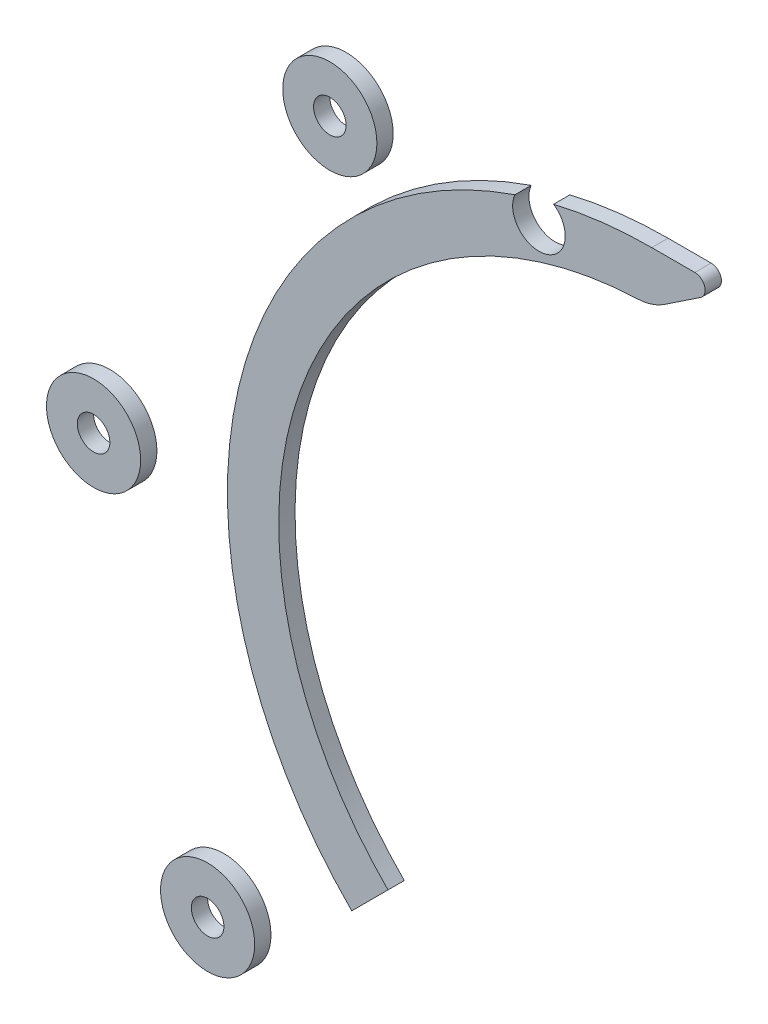
ISO-10303-21;
HEADER;
FILE_DESCRIPTION(('STEP AP214'),'2;1');
FILE_NAME('part.step','',(''),(''),'','','');
FILE_SCHEMA(('AUTOMOTIVE_DESIGN { 1 0 10303 214 1 1 1 1 }'));
ENDSEC;
DATA;
#1=APPLICATION_CONTEXT('core data for automotive mechanical design processes');
#2=APPLICATION_PROTOCOL_DEFINITION('international standard','automotive_design',2000,#1);
#3=PRODUCT_CONTEXT('',#1,'mechanical');
#4=PRODUCT('Part','Part','',(#3));
#5=PRODUCT_RELATED_PRODUCT_CATEGORY('part','',(#4));
#6=PRODUCT_DEFINITION_FORMATION('','',#4);
#7=PRODUCT_DEFINITION_CONTEXT('part definition',#1,'design');
#8=PRODUCT_DEFINITION('design','',#6,#7);
#9=PRODUCT_DEFINITION_SHAPE('','',#8);
#10=(LENGTH_UNIT() NAMED_UNIT(*) SI_UNIT(.MILLI.,.METRE.));
#11=(NAMED_UNIT(*) PLANE_ANGLE_UNIT() SI_UNIT($,.RADIAN.));
#12=(NAMED_UNIT(*) SI_UNIT($,.STERADIAN.) SOLID_ANGLE_UNIT());
#13=UNCERTAINTY_MEASURE_WITH_UNIT(LENGTH_MEASURE(1.E-05),#10,'distance_accuracy_value','');
#14=(GEOMETRIC_REPRESENTATION_CONTEXT(3) GLOBAL_UNCERTAINTY_ASSIGNED_CONTEXT((#13)) GLOBAL_UNIT_ASSIGNED_CONTEXT((#10,
#11,#12)) REPRESENTATION_CONTEXT('',''));
#15=CARTESIAN_POINT('',(0.,0.,0.));
#16=DIRECTION('',(0.,0.,1.));
#17=DIRECTION('',(1.,0.,0.));
#18=AXIS2_PLACEMENT_3D('',#15,#16,#17);
#19=CARTESIAN_POINT('',(-86.5859641184804,-73.6105546837081,-3.175));
#20=DIRECTION('',(0.,0.,1.));
#21=DIRECTION('',(1.,0.,0.));
#22=AXIS2_PLACEMENT_3D('',#19,#20,#21);
#23=CYLINDRICAL_SURFACE('',#22,3.175);
#24=CARTESIAN_POINT('',(-86.5859641184804,-73.6105546837081,-3.175));
#25=DIRECTION('',(0.,0.,1.));
#26=DIRECTION('',(1.,0.,0.));
#27=AXIS2_PLACEMENT_3D('',#24,#25,#26);
#28=CIRCLE('',#27,3.175);
#29=CARTESIAN_POINT('',(-83.4109641184804,-73.6105546837081,-3.175));
#30=VERTEX_POINT('',#29);
#31=EDGE_CURVE('E65',#30,#30,#28,.T.);
#32=ORIENTED_EDGE('',*,*,#31,.F.);
#33=EDGE_LOOP('',(#32));
#34=FACE_BOUND('',#33,.T.);
#35=CARTESIAN_POINT('',(-86.5859641184804,-73.6105546837081,0.));
#36=DIRECTION('',(0.,0.,1.));
#37=DIRECTION('',(1.,0.,0.));
#38=AXIS2_PLACEMENT_3D('',#35,#36,#37);
#39=CIRCLE('',#38,3.175);
#40=CARTESIAN_POINT('',(-83.4109641184804,-73.6105546837081,0.));
#41=VERTEX_POINT('',#40);
#42=EDGE_CURVE('E71',#41,#41,#39,.T.);
#43=ORIENTED_EDGE('',*,*,#42,.T.);
#44=EDGE_LOOP('',(#43));
#45=FACE_BOUND('',#44,.T.);
#46=ADVANCED_FACE('F58',(#34,#45),#23,.F.);
#47=CARTESIAN_POINT('',(-86.5859641184804,-73.6105546837081,-3.175));
#48=DIRECTION('',(0.,0.,1.));
#49=DIRECTION('',(1.,0.,0.));
#50=AXIS2_PLACEMENT_3D('',#47,#48,#49);
#51=CYLINDRICAL_SURFACE('',#50,9.175);
#52=CARTESIAN_POINT('',(-86.5859641184804,-73.6105546837081,-3.175));
#53=DIRECTION('',(0.,0.,1.));
#54=DIRECTION('',(1.,0.,0.));
#55=AXIS2_PLACEMENT_3D('',#52,#53,#54);
#56=CIRCLE('',#55,9.175);
#57=CARTESIAN_POINT('',(-77.4109641184804,-73.6105546837081,-3.175));
#58=VERTEX_POINT('',#57);
#59=EDGE_CURVE('E12',#58,#58,#56,.T.);
#60=ORIENTED_EDGE('',*,*,#59,.T.);
#61=EDGE_LOOP('',(#60));
#62=FACE_BOUND('',#61,.T.);
#63=CARTESIAN_POINT('',(-86.5859641184804,-73.6105546837081,0.));
#64=DIRECTION('',(0.,0.,1.));
#65=DIRECTION('',(1.,0.,0.));
#66=AXIS2_PLACEMENT_3D('',#63,#64,#65);
#67=CIRCLE('',#66,9.175);
#68=CARTESIAN_POINT('',(-77.4109641184804,-73.6105546837081,0.));
#69=VERTEX_POINT('',#68);
#70=EDGE_CURVE('E61',#69,#69,#67,.T.);
#71=ORIENTED_EDGE('',*,*,#70,.F.);
#72=EDGE_LOOP('',(#71));
#73=FACE_BOUND('',#72,.T.);
#74=ADVANCED_FACE('F80',(#62,#73),#51,.T.);
#75=CARTESIAN_POINT('',(0.,0.,-3.175));
#76=DIRECTION('',(0.,0.,1.));
#77=DIRECTION('',(1.,0.,0.));
#78=AXIS2_PLACEMENT_3D('',#75,#76,#77);
#79=PLANE('',#78);
#80=ORIENTED_EDGE('',*,*,#31,.T.);
#81=EDGE_LOOP('',(#80));
#82=FACE_BOUND('',#81,.T.);
#83=ORIENTED_EDGE('',*,*,#59,.F.);
#84=EDGE_LOOP('',(#83));
#85=FACE_BOUND('',#84,.T.);
#86=ADVANCED_FACE('F82',(#82,#85),#79,.F.);
#87=CARTESIAN_POINT('',(0.,0.,0.));
#88=DIRECTION('',(0.,0.,1.));
#89=DIRECTION('',(1.,0.,0.));
#90=AXIS2_PLACEMENT_3D('',#87,#88,#89);
#91=PLANE('',#90);
#92=ORIENTED_EDGE('',*,*,#42,.F.);
#93=EDGE_LOOP('',(#92));
#94=FACE_BOUND('',#93,.T.);
#95=ORIENTED_EDGE('',*,*,#70,.T.);
#96=EDGE_LOOP('',(#95));
#97=FACE_BOUND('',#96,.T.);
#98=ADVANCED_FACE('F78',(#94,#97),#91,.T.);
#99=CLOSED_SHELL('',(#46,#74,#86,#98));
#100=MANIFOLD_SOLID_BREP('B2',#99);
#101=CARTESIAN_POINT('',(-108.81658982148,-3.00343431559438,-3.175));
#102=DIRECTION('',(0.,0.,1.));
#103=DIRECTION('',(1.,0.,0.));
#104=AXIS2_PLACEMENT_3D('',#101,#102,#103);
#105=CYLINDRICAL_SURFACE('',#104,3.175);
#106=CARTESIAN_POINT('',(-108.81658982148,-3.00343431559438,-3.175));
#107=DIRECTION('',(0.,0.,1.));
#108=DIRECTION('',(1.,0.,0.));
#109=AXIS2_PLACEMENT_3D('',#106,#107,#108);
#110=CIRCLE('',#109,3.175);
#111=CARTESIAN_POINT('',(-105.64158982148,-3.00343431559438,-3.175));
#112=VERTEX_POINT('',#111);
#113=EDGE_CURVE('E134',#112,#112,#110,.T.);
#114=ORIENTED_EDGE('',*,*,#113,.F.);
#115=EDGE_LOOP('',(#114));
#116=FACE_BOUND('',#115,.T.);
#117=CARTESIAN_POINT('',(-108.81658982148,-3.00343431559438,0.));
#118=DIRECTION('',(0.,0.,1.));
#119=DIRECTION('',(1.,0.,0.));
#120=AXIS2_PLACEMENT_3D('',#117,#118,#119);
#121=CIRCLE('',#120,3.175);
#122=CARTESIAN_POINT('',(-105.64158982148,-3.00343431559438,0.));
#123=VERTEX_POINT('',#122);
#124=EDGE_CURVE('E140',#123,#123,#121,.T.);
#125=ORIENTED_EDGE('',*,*,#124,.T.);
#126=EDGE_LOOP('',(#125));
#127=FACE_BOUND('',#126,.T.);
#128=ADVANCED_FACE('F127',(#116,#127),#105,.F.);
#129=CARTESIAN_POINT('',(-108.81658982148,-3.00343431559438,-3.175));
#130=DIRECTION('',(0.,0.,1.));
#131=DIRECTION('',(1.,0.,0.));
#132=AXIS2_PLACEMENT_3D('',#129,#130,#131);
#133=CYLINDRICAL_SURFACE('',#132,9.17499999999998);
#134=CARTESIAN_POINT('',(-108.81658982148,-3.00343431559438,-3.175));
#135=DIRECTION('',(0.,0.,1.));
#136=DIRECTION('',(1.,0.,0.));
#137=AXIS2_PLACEMENT_3D('',#134,#135,#136);
#138=CIRCLE('',#137,9.17499999999998);
#139=CARTESIAN_POINT('',(-99.6415898214804,-3.00343431559438,-3.175));
#140=VERTEX_POINT('',#139);
#141=EDGE_CURVE('E57',#140,#140,#138,.T.);
#142=ORIENTED_EDGE('',*,*,#141,.T.);
#143=EDGE_LOOP('',(#142));
#144=FACE_BOUND('',#143,.T.);
#145=CARTESIAN_POINT('',(-108.81658982148,-3.00343431559438,0.));
#146=DIRECTION('',(0.,0.,1.));
#147=DIRECTION('',(1.,0.,0.));
#148=AXIS2_PLACEMENT_3D('',#145,#146,#147);
#149=CIRCLE('',#148,9.17499999999998);
#150=CARTESIAN_POINT('',(-99.6415898214804,-3.00343431559438,0.));
#151=VERTEX_POINT('',#150);
#152=EDGE_CURVE('E130',#151,#151,#149,.T.);
#153=ORIENTED_EDGE('',*,*,#152,.F.);
#154=EDGE_LOOP('',(#153));
#155=FACE_BOUND('',#154,.T.);
#156=ADVANCED_FACE('F149',(#144,#155),#133,.T.);
#157=CARTESIAN_POINT('',(0.,0.,-3.175));
#158=DIRECTION('',(0.,0.,1.));
#159=DIRECTION('',(1.,0.,0.));
#160=AXIS2_PLACEMENT_3D('',#157,#158,#159);
#161=PLANE('',#160);
#162=ORIENTED_EDGE('',*,*,#113,.T.);
#163=EDGE_LOOP('',(#162));
#164=FACE_BOUND('',#163,.T.);
#165=ORIENTED_EDGE('',*,*,#141,.F.);
#166=EDGE_LOOP('',(#165));
#167=FACE_BOUND('',#166,.T.);
#168=ADVANCED_FACE('F151',(#164,#167),#161,.F.);
#169=CARTESIAN_POINT('',(0.,0.,0.));
#170=DIRECTION('',(0.,0.,1.));
#171=DIRECTION('',(1.,0.,0.));
#172=AXIS2_PLACEMENT_3D('',#169,#170,#171);
#173=PLANE('',#172);
#174=ORIENTED_EDGE('',*,*,#124,.F.);
#175=EDGE_LOOP('',(#174));
#176=FACE_BOUND('',#175,.T.);
#177=ORIENTED_EDGE('',*,*,#152,.T.);
#178=EDGE_LOOP('',(#177));
#179=FACE_BOUND('',#178,.T.);
#180=ADVANCED_FACE('F147',(#176,#179),#173,.T.);
#181=CLOSED_SHELL('',(#128,#156,#168,#180));
#182=MANIFOLD_SOLID_BREP('B7',#181);
#183=CARTESIAN_POINT('',(-62.7632545375718,73.5491765689237,-3.175));
#184=DIRECTION('',(0.,0.,1.));
#185=DIRECTION('',(1.,0.,0.));
#186=AXIS2_PLACEMENT_3D('',#183,#184,#185);
#187=CYLINDRICAL_SURFACE('',#186,3.175);
#188=CARTESIAN_POINT('',(-62.7632545375718,73.5491765689237,-3.175));
#189=DIRECTION('',(0.,0.,1.));
#190=DIRECTION('',(1.,0.,0.));
#191=AXIS2_PLACEMENT_3D('',#188,#189,#190);
#192=CIRCLE('',#191,3.175);
#193=CARTESIAN_POINT('',(-59.5882545375718,73.5491765689237,-3.175));
#194=VERTEX_POINT('',#193);
#195=EDGE_CURVE('E204',#194,#194,#192,.T.);
#196=ORIENTED_EDGE('',*,*,#195,.F.);
#197=EDGE_LOOP('',(#196));
#198=FACE_BOUND('',#197,.T.);
#199=CARTESIAN_POINT('',(-62.7632545375718,73.5491765689237,0.));
#200=DIRECTION('',(0.,0.,1.));
#201=DIRECTION('',(1.,0.,0.));
#202=AXIS2_PLACEMENT_3D('',#199,#200,#201);
#203=CIRCLE('',#202,3.175);
#204=CARTESIAN_POINT('',(-59.5882545375718,73.5491765689237,0.));
#205=VERTEX_POINT('',#204);
#206=EDGE_CURVE('E210',#205,#205,#203,.T.);
#207=ORIENTED_EDGE('',*,*,#206,.T.);
#208=EDGE_LOOP('',(#207));
#209=FACE_BOUND('',#208,.T.);
#210=ADVANCED_FACE('F197',(#198,#209),#187,.F.);
#211=CARTESIAN_POINT('',(-62.7632545375718,73.5491765689237,-3.175));
#212=DIRECTION('',(0.,0.,1.));
#213=DIRECTION('',(1.,0.,0.));
#214=AXIS2_PLACEMENT_3D('',#211,#212,#213);
#215=CYLINDRICAL_SURFACE('',#214,9.175);
#216=CARTESIAN_POINT('',(-62.7632545375718,73.5491765689237,-3.175));
#217=DIRECTION('',(0.,0.,1.));
#218=DIRECTION('',(1.,0.,0.));
#219=AXIS2_PLACEMENT_3D('',#216,#217,#218);
#220=CIRCLE('',#219,9.175);
#221=CARTESIAN_POINT('',(-53.5882545375718,73.5491765689237,-3.175));
#222=VERTEX_POINT('',#221);
#223=EDGE_CURVE('E126',#222,#222,#220,.T.);
#224=ORIENTED_EDGE('',*,*,#223,.T.);
#225=EDGE_LOOP('',(#224));
#226=FACE_BOUND('',#225,.T.);
#227=CARTESIAN_POINT('',(-62.7632545375718,73.5491765689237,0.));
#228=DIRECTION('',(0.,0.,1.));
#229=DIRECTION('',(1.,0.,0.));
#230=AXIS2_PLACEMENT_3D('',#227,#228,#229);
#231=CIRCLE('',#230,9.175);
#232=CARTESIAN_POINT('',(-53.5882545375718,73.5491765689237,0.));
#233=VERTEX_POINT('',#232);
#234=EDGE_CURVE('E200',#233,#233,#231,.T.);
#235=ORIENTED_EDGE('',*,*,#234,.F.);
#236=EDGE_LOOP('',(#235));
#237=FACE_BOUND('',#236,.T.);
#238=ADVANCED_FACE('F219',(#226,#237),#215,.T.);
#239=CARTESIAN_POINT('',(0.,0.,-3.175));
#240=DIRECTION('',(0.,0.,1.));
#241=DIRECTION('',(1.,0.,0.));
#242=AXIS2_PLACEMENT_3D('',#239,#240,#241);
#243=PLANE('',#242);
#244=ORIENTED_EDGE('',*,*,#195,.T.);
#245=EDGE_LOOP('',(#244));
#246=FACE_BOUND('',#245,.T.);
#247=ORIENTED_EDGE('',*,*,#223,.F.);
#248=EDGE_LOOP('',(#247));
#249=FACE_BOUND('',#248,.T.);
#250=ADVANCED_FACE('F221',(#246,#249),#243,.F.);
#251=CARTESIAN_POINT('',(0.,0.,0.));
#252=DIRECTION('',(0.,0.,1.));
#253=DIRECTION('',(1.,0.,0.));
#254=AXIS2_PLACEMENT_3D('',#251,#252,#253);
#255=PLANE('',#254);
#256=ORIENTED_EDGE('',*,*,#206,.F.);
#257=EDGE_LOOP('',(#256));
#258=FACE_BOUND('',#257,.T.);
#259=ORIENTED_EDGE('',*,*,#234,.T.);
#260=EDGE_LOOP('',(#259));
#261=FACE_BOUND('',#260,.T.);
#262=ADVANCED_FACE('F217',(#258,#261),#255,.T.);
#263=CLOSED_SHELL('',(#210,#238,#250,#262));
#264=MANIFOLD_SOLID_BREP('B52',#263);
#265=CARTESIAN_POINT('',(0.,0.,-3.175));
#266=DIRECTION('',(0.,0.,1.));
#267=DIRECTION('',(1.,0.,0.));
#268=AXIS2_PLACEMENT_3D('',#265,#266,#267);
#269=CYLINDRICAL_SURFACE('',#268,82.7241765689237);
#270=DIRECTION('',(0.,0.,-1.));
#271=VECTOR('',#270,1.);
#272=CARTESIAN_POINT('',(-26.6848906741005,78.3020178457604,1.825));
#273=LINE('',#272,#271);
#274=CARTESIAN_POINT('',(-26.6848906741005,78.3020178457604,-3.175));
#275=VERTEX_POINT('',#274);
#276=CARTESIAN_POINT('',(-26.6848906741004,78.3020178457603,0.));
#277=VERTEX_POINT('',#276);
#278=EDGE_CURVE('E357',#275,#277,#273,.F.);
#279=ORIENTED_EDGE('',*,*,#278,.F.);
#280=CARTESIAN_POINT('',(0.,0.,-3.175));
#281=DIRECTION('',(0.,0.,1.));
#282=DIRECTION('',(1.,0.,0.));
#283=AXIS2_PLACEMENT_3D('',#280,#281,#282);
#284=CIRCLE('',#283,82.7241765689237);
#285=CARTESIAN_POINT('',(-58.4948262199589,-58.4948262199596,-3.175));
#286=VERTEX_POINT('',#285);
#287=EDGE_CURVE('E351',#275,#286,#284,.T.);
#288=ORIENTED_EDGE('',*,*,#287,.T.);
#289=DIRECTION('',(0.,0.,1.));
#290=VECTOR('',#289,1.);
#291=CARTESIAN_POINT('',(-58.4948262199589,-58.4948262199596,-3.175));
#292=LINE('',#291,#290);
#293=CARTESIAN_POINT('',(-58.4948262199589,-58.4948262199596,0.));
#294=VERTEX_POINT('',#293);
#295=EDGE_CURVE('E343',#286,#294,#292,.T.);
#296=ORIENTED_EDGE('',*,*,#295,.T.);
#297=CARTESIAN_POINT('',(0.,0.,0.));
#298=DIRECTION('',(0.,0.,1.));
#299=DIRECTION('',(1.,0.,0.));
#300=AXIS2_PLACEMENT_3D('',#297,#298,#299);
#301=CIRCLE('',#300,82.7241765689237);
#302=EDGE_CURVE('E363',#277,#294,#301,.T.);
#303=ORIENTED_EDGE('',*,*,#302,.F.);
#304=EDGE_LOOP('',(#279,#288,#296,#303));
#305=FACE_BOUND('',#304,.T.);
#306=ADVANCED_FACE('F258',(#305),#269,.T.);
#307=CARTESIAN_POINT('',(0.,0.,-3.175));
#308=DIRECTION('',(0.,0.,1.));
#309=DIRECTION('',(1.,0.,0.));
#310=AXIS2_PLACEMENT_3D('',#307,#308,#309);
#311=CYLINDRICAL_SURFACE('',#310,72.7241765689237);
#312=CARTESIAN_POINT('',(0.,0.,-3.175));
#313=DIRECTION('',(0.,0.,1.));
#314=DIRECTION('',(1.,0.,0.));
#315=AXIS2_PLACEMENT_3D('',#312,#313,#314);
#316=CIRCLE('',#315,72.7241765689237);
#317=CARTESIAN_POINT('',(-2.73915530304489,72.672573133568,-3.175));
#318=VERTEX_POINT('',#317);
#319=CARTESIAN_POINT('',(-51.4237584080935,-51.4237584080941,-3.175));
#320=VERTEX_POINT('',#319);
#321=EDGE_CURVE('E344',#318,#320,#316,.T.);
#322=ORIENTED_EDGE('',*,*,#321,.F.);
#323=DIRECTION('',(0.,0.,1.));
#324=VECTOR('',#323,1.);
#325=CARTESIAN_POINT('',(-2.7391553030449,72.6725731335681,-3.175));
#326=LINE('',#325,#324);
#327=CARTESIAN_POINT('',(-2.73915530304489,72.672573133568,0.));
#328=VERTEX_POINT('',#327);
#329=EDGE_CURVE('E374',#318,#328,#326,.T.);
#330=ORIENTED_EDGE('',*,*,#329,.T.);
#331=CARTESIAN_POINT('',(0.,0.,0.));
#332=DIRECTION('',(0.,0.,1.));
#333=DIRECTION('',(1.,0.,0.));
#334=AXIS2_PLACEMENT_3D('',#331,#332,#333);
#335=CIRCLE('',#334,72.7241765689237);
#336=CARTESIAN_POINT('',(-51.4237584080935,-51.4237584080941,0.));
#337=VERTEX_POINT('',#336);
#338=EDGE_CURVE('E355',#328,#337,#335,.T.);
#339=ORIENTED_EDGE('',*,*,#338,.T.);
#340=DIRECTION('',(0.,0.,1.));
#341=VECTOR('',#340,1.);
#342=CARTESIAN_POINT('',(-51.4237584080935,-51.4237584080941,-3.175));
#343=LINE('',#342,#341);
#344=EDGE_CURVE('E367',#320,#337,#343,.T.);
#345=ORIENTED_EDGE('',*,*,#344,.F.);
#346=EDGE_LOOP('',(#322,#330,#339,#345));
#347=FACE_BOUND('',#346,.T.);
#348=ADVANCED_FACE('F415',(#347),#311,.F.);
#349=CARTESIAN_POINT('',(0.,0.,-3.175));
#350=DIRECTION('',(-0.707106781186551,0.707106781186544,0.));
#351=DIRECTION('',(-0.707106781186544,-0.707106781186551,0.));
#352=AXIS2_PLACEMENT_3D('',#349,#350,#351);
#353=PLANE('',#352);
#354=DIRECTION('',(-0.707106781186544,-0.707106781186551,0.));
#355=VECTOR('',#354,1.);
#356=CARTESIAN_POINT('',(0.,0.,0.));
#357=LINE('',#356,#355);
#358=EDGE_CURVE('E362',#337,#294,#357,.T.);
#359=ORIENTED_EDGE('',*,*,#358,.T.);
#360=ORIENTED_EDGE('',*,*,#295,.F.);
#361=DIRECTION('',(-0.707106781186544,-0.707106781186551,0.));
#362=VECTOR('',#361,1.);
#363=CARTESIAN_POINT('',(0.,0.,-3.175));
#364=LINE('',#363,#362);
#365=EDGE_CURVE('E350',#320,#286,#364,.T.);
#366=ORIENTED_EDGE('',*,*,#365,.F.);
#367=ORIENTED_EDGE('',*,*,#344,.T.);
#368=EDGE_LOOP('',(#359,#360,#366,#367));
#369=FACE_BOUND('',#368,.T.);
#370=ADVANCED_FACE('F411',(#369),#353,.F.);
#371=DIRECTION('',(0.,0.,-1.));
#372=VECTOR('',#371,1.);
#373=CARTESIAN_POINT('',(-19.1428090582087,80.4788310698375,1.825));
#374=LINE('',#373,#372);
#375=CARTESIAN_POINT('',(-19.1428090582087,80.4788310698374,0.));
#376=VERTEX_POINT('',#375);
#377=CARTESIAN_POINT('',(-19.1428090582087,80.4788310698375,-3.175));
#378=VERTEX_POINT('',#377);
#379=EDGE_CURVE('E401',#376,#378,#374,.T.);
#380=ORIENTED_EDGE('',*,*,#379,.F.);
#381=CARTESIAN_POINT('',(0.,82.7241765689237,0.));
#382=VERTEX_POINT('',#381);
#383=EDGE_CURVE('E342',#382,#376,#301,.T.);
#384=ORIENTED_EDGE('',*,*,#383,.F.);
#385=DIRECTION('',(0.,0.,1.));
#386=VECTOR('',#385,1.);
#387=CARTESIAN_POINT('',(0.,82.7241765689237,-3.175));
#388=LINE('',#387,#386);
#389=CARTESIAN_POINT('',(0.,82.7241765689237,-3.175));
#390=VERTEX_POINT('',#389);
#391=EDGE_CURVE('E328',#390,#382,#388,.T.);
#392=ORIENTED_EDGE('',*,*,#391,.F.);
#393=EDGE_CURVE('E340',#390,#378,#284,.T.);
#394=ORIENTED_EDGE('',*,*,#393,.T.);
#395=EDGE_LOOP('',(#380,#384,#392,#394));
#396=FACE_BOUND('',#395,.T.);
#397=ADVANCED_FACE('F339',(#396),#269,.T.);
#398=CARTESIAN_POINT('',(0.,0.,-3.175));
#399=DIRECTION('',(0.,0.,1.));
#400=DIRECTION('',(1.,0.,0.));
#401=AXIS2_PLACEMENT_3D('',#398,#399,#400);
#402=PLANE('',#401);
#403=DIRECTION('',(1.,0.,0.));
#404=VECTOR('',#403,1.);
#405=CARTESIAN_POINT('',(0.,82.7241765689237,-3.175));
#406=LINE('',#405,#404);
#407=CARTESIAN_POINT('',(8.394448724536,82.7241765689237,-3.175));
#408=VERTEX_POINT('',#407);
#409=EDGE_CURVE('E325',#390,#408,#406,.T.);
#410=ORIENTED_EDGE('',*,*,#409,.T.);
#411=CARTESIAN_POINT('',(8.394448724536,80.7241765689237,-3.175));
#412=DIRECTION('',(0.,0.,1.));
#413=DIRECTION('',(1.,0.,0.));
#414=AXIS2_PLACEMENT_3D('',#411,#412,#413);
#415=CIRCLE('',#414,2.);
#416=CARTESIAN_POINT('',(9.50384911698645,79.060075980248,-3.175));
#417=VERTEX_POINT('',#416);
#418=EDGE_CURVE('E195',#408,#417,#415,.F.);
#419=ORIENTED_EDGE('',*,*,#418,.T.);
#420=DIRECTION('',(-0.832050294337844,-0.554700196225229,0.));
#421=VECTOR('',#420,1.);
#422=CARTESIAN_POINT('',(15.,82.7241765689237,-3.175));
#423=LINE('',#422,#421);
#424=CARTESIAN_POINT('',(2.43119677023286,74.3449744157456,-3.175));
#425=VERTEX_POINT('',#424);
#426=EDGE_CURVE('E333',#417,#425,#423,.T.);
#427=ORIENTED_EDGE('',*,*,#426,.T.);
#428=CARTESIAN_POINT('',(-3.11580519201942,82.6654773591241,-3.175));
#429=DIRECTION('',(0.,0.,1.));
#430=DIRECTION('',(1.,0.,0.));
#431=AXIS2_PLACEMENT_3D('',#428,#429,#430);
#432=CIRCLE('',#431,10.);
#433=EDGE_CURVE('E382',#425,#318,#432,.F.);
#434=ORIENTED_EDGE('',*,*,#433,.T.);
#435=ORIENTED_EDGE('',*,*,#321,.T.);
#436=ORIENTED_EDGE('',*,*,#365,.T.);
#437=ORIENTED_EDGE('',*,*,#287,.F.);
#438=CARTESIAN_POINT('',(-22.,76.2241765689237,-3.175));
#439=DIRECTION('',(0.,0.,-1.));
#440=DIRECTION('',(-1.,0.,0.));
#441=AXIS2_PLACEMENT_3D('',#438,#439,#440);
#442=CIRCLE('',#441,5.125);
#443=EDGE_CURVE('E349',#378,#275,#442,.T.);
#444=ORIENTED_EDGE('',*,*,#443,.F.);
#445=ORIENTED_EDGE('',*,*,#393,.F.);
#446=EDGE_LOOP('',(#410,#419,#427,#434,#435,#436,#437,#444,#445));
#447=FACE_BOUND('',#446,.T.);
#448=ADVANCED_FACE('F347',(#447),#402,.F.);
#449=CARTESIAN_POINT('',(0.,0.,0.));
#450=DIRECTION('',(0.,0.,1.));
#451=DIRECTION('',(1.,0.,0.));
#452=AXIS2_PLACEMENT_3D('',#449,#450,#451);
#453=PLANE('',#452);
#454=DIRECTION('',(0.832050294337844,0.554700196225229,0.));
#455=VECTOR('',#454,1.);
#456=CARTESIAN_POINT('',(15.,82.7241765689237,0.));
#457=LINE('',#456,#455);
#458=CARTESIAN_POINT('',(2.43119677023286,74.3449744157456,0.));
#459=VERTEX_POINT('',#458);
#460=CARTESIAN_POINT('',(9.50384911698645,79.060075980248,0.));
#461=VERTEX_POINT('',#460);
#462=EDGE_CURVE('E392',#459,#461,#457,.T.);
#463=ORIENTED_EDGE('',*,*,#462,.T.);
#464=CARTESIAN_POINT('',(8.394448724536,80.7241765689237,0.));
#465=DIRECTION('',(0.,0.,1.));
#466=DIRECTION('',(1.,0.,0.));
#467=AXIS2_PLACEMENT_3D('',#464,#465,#466);
#468=CIRCLE('',#467,2.);
#469=CARTESIAN_POINT('',(8.394448724536,82.7241765689237,0.));
#470=VERTEX_POINT('',#469);
#471=EDGE_CURVE('E280',#461,#470,#468,.T.);
#472=ORIENTED_EDGE('',*,*,#471,.T.);
#473=DIRECTION('',(-1.,0.,0.));
#474=VECTOR('',#473,1.);
#475=CARTESIAN_POINT('',(0.,82.7241765689237,0.));
#476=LINE('',#475,#474);
#477=EDGE_CURVE('E334',#470,#382,#476,.T.);
#478=ORIENTED_EDGE('',*,*,#477,.T.);
#479=ORIENTED_EDGE('',*,*,#383,.T.);
#480=CARTESIAN_POINT('',(-22.,76.2241765689237,0.));
#481=DIRECTION('',(0.,0.,1.));
#482=DIRECTION('',(1.,0.,0.));
#483=AXIS2_PLACEMENT_3D('',#480,#481,#482);
#484=CIRCLE('',#483,5.125);
#485=EDGE_CURVE('E370',#277,#376,#484,.T.);
#486=ORIENTED_EDGE('',*,*,#485,.F.);
#487=ORIENTED_EDGE('',*,*,#302,.T.);
#488=ORIENTED_EDGE('',*,*,#358,.F.);
#489=ORIENTED_EDGE('',*,*,#338,.F.);
#490=CARTESIAN_POINT('',(-3.11580519201942,82.6654773591241,0.));
#491=DIRECTION('',(0.,0.,1.));
#492=DIRECTION('',(1.,0.,0.));
#493=AXIS2_PLACEMENT_3D('',#490,#491,#492);
#494=CIRCLE('',#493,10.);
#495=EDGE_CURVE('E377',#328,#459,#494,.T.);
#496=ORIENTED_EDGE('',*,*,#495,.T.);
#497=EDGE_LOOP('',(#463,#472,#478,#479,#486,#487,#488,#489,#496));
#498=FACE_BOUND('',#497,.T.);
#499=ADVANCED_FACE('F395',(#498),#453,.T.);
#500=CARTESIAN_POINT('',(-22.,76.2241765689237,6.825));
#501=DIRECTION('',(0.,0.,-1.));
#502=DIRECTION('',(-1.,0.,0.));
#503=AXIS2_PLACEMENT_3D('',#500,#501,#502);
#504=CYLINDRICAL_SURFACE('',#503,5.125);
#505=ORIENTED_EDGE('',*,*,#278,.T.);
#506=ORIENTED_EDGE('',*,*,#485,.T.);
#507=ORIENTED_EDGE('',*,*,#379,.T.);
#508=ORIENTED_EDGE('',*,*,#443,.T.);
#509=EDGE_LOOP('',(#505,#506,#507,#508));
#510=FACE_BOUND('',#509,.T.);
#511=ADVANCED_FACE('F441',(#510),#504,.F.);
#512=CARTESIAN_POINT('',(0.,82.7241765689237,-21.2027563773199));
#513=DIRECTION('',(0.,1.,0.));
#514=DIRECTION('',(0.,0.,1.));
#515=AXIS2_PLACEMENT_3D('',#512,#513,#514);
#516=PLANE('',#515);
#517=ORIENTED_EDGE('',*,*,#477,.F.);
#518=DIRECTION('',(0.,0.,1.));
#519=VECTOR('',#518,1.);
#520=CARTESIAN_POINT('',(8.394448724536,82.7241765689237,-21.2027563773199));
#521=LINE('',#520,#519);
#522=EDGE_CURVE('E266',#470,#408,#521,.F.);
#523=ORIENTED_EDGE('',*,*,#522,.T.);
#524=ORIENTED_EDGE('',*,*,#409,.F.);
#525=ORIENTED_EDGE('',*,*,#391,.T.);
#526=EDGE_LOOP('',(#517,#523,#524,#525));
#527=FACE_BOUND('',#526,.T.);
#528=ADVANCED_FACE('F327',(#527),#516,.T.);
#529=CARTESIAN_POINT('',(15.,82.7241765689237,-21.2027563773199));
#530=DIRECTION('',(0.554700196225229,-0.832050294337844,0.));
#531=DIRECTION('',(0.832050294337844,0.554700196225229,0.));
#532=AXIS2_PLACEMENT_3D('',#529,#530,#531);
#533=PLANE('',#532);
#534=ORIENTED_EDGE('',*,*,#426,.F.);
#535=DIRECTION('',(0.,0.,1.));
#536=VECTOR('',#535,1.);
#537=CARTESIAN_POINT('',(9.50384911698645,79.060075980248,-21.2027563773199));
#538=LINE('',#537,#536);
#539=EDGE_CURVE('E384',#417,#461,#538,.T.);
#540=ORIENTED_EDGE('',*,*,#539,.T.);
#541=ORIENTED_EDGE('',*,*,#462,.F.);
#542=DIRECTION('',(0.,0.,-1.));
#543=VECTOR('',#542,1.);
#544=CARTESIAN_POINT('',(2.43119677023286,74.3449744157456,-3.175));
#545=LINE('',#544,#543);
#546=EDGE_CURVE('E379',#459,#425,#545,.T.);
#547=ORIENTED_EDGE('',*,*,#546,.T.);
#548=EDGE_LOOP('',(#534,#540,#541,#547));
#549=FACE_BOUND('',#548,.T.);
#550=ADVANCED_FACE('F391',(#549),#533,.T.);
#551=CARTESIAN_POINT('',(-3.11580519201942,82.6654773591241,-3.175));
#552=DIRECTION('',(0.,0.,1.));
#553=DIRECTION('',(1.,0.,0.));
#554=AXIS2_PLACEMENT_3D('',#551,#552,#553);
#555=CYLINDRICAL_SURFACE('',#554,10.);
#556=ORIENTED_EDGE('',*,*,#433,.F.);
#557=ORIENTED_EDGE('',*,*,#546,.F.);
#558=ORIENTED_EDGE('',*,*,#495,.F.);
#559=ORIENTED_EDGE('',*,*,#329,.F.);
#560=EDGE_LOOP('',(#556,#557,#558,#559));
#561=FACE_BOUND('',#560,.T.);
#562=ADVANCED_FACE('F419',(#561),#555,.T.);
#563=CARTESIAN_POINT('',(8.394448724536,80.7241765689237,-21.2027563773199));
#564=DIRECTION('',(0.,0.,1.));
#565=DIRECTION('',(1.,0.,0.));
#566=AXIS2_PLACEMENT_3D('',#563,#564,#565);
#567=CYLINDRICAL_SURFACE('',#566,2.);
#568=ORIENTED_EDGE('',*,*,#418,.F.);
#569=ORIENTED_EDGE('',*,*,#522,.F.);
#570=ORIENTED_EDGE('',*,*,#471,.F.);
#571=ORIENTED_EDGE('',*,*,#539,.F.);
#572=EDGE_LOOP('',(#568,#569,#570,#571));
#573=FACE_BOUND('',#572,.T.);
#574=ADVANCED_FACE('F260',(#573),#567,.T.);
#575=CLOSED_SHELL('',(#306,#348,#370,#397,#448,#499,#511,#528,#550,#562,#574));
#576=MANIFOLD_SOLID_BREP('B121',#575);
#577=ADVANCED_BREP_SHAPE_REPRESENTATION('',(#18,#100,#182,#264,#576),#14);
#578=SHAPE_DEFINITION_REPRESENTATION(#9,#577);
ENDSEC;
END-ISO-10303-21;
